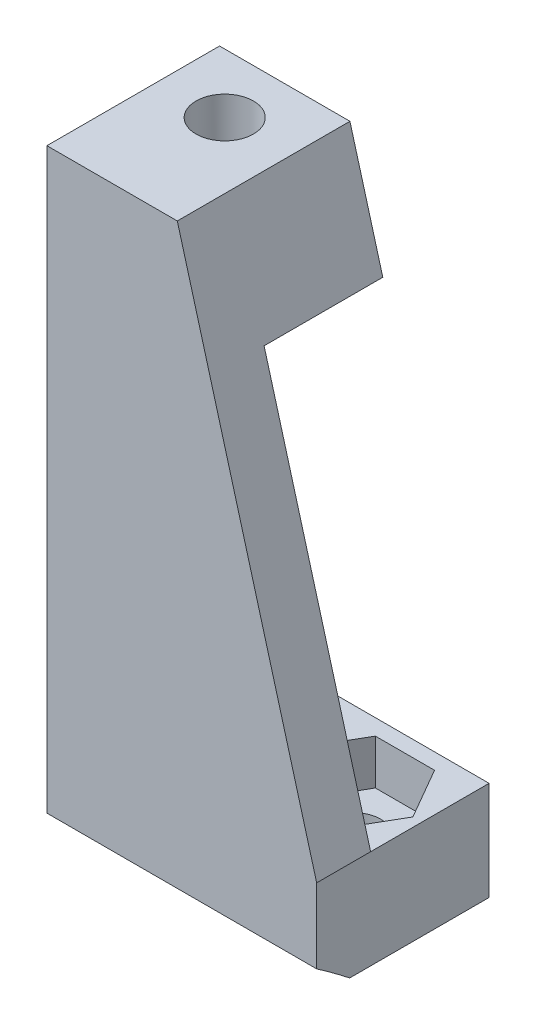
ISO-10303-21;
HEADER;
FILE_DESCRIPTION(('STEP AP214'),'2;1');
FILE_NAME('part.step','',(''),(''),'','','');
FILE_SCHEMA(('AUTOMOTIVE_DESIGN { 1 0 10303 214 1 1 1 1 }'));
ENDSEC;
DATA;
#1=APPLICATION_CONTEXT('core data for automotive mechanical design processes');
#2=APPLICATION_PROTOCOL_DEFINITION('international standard','automotive_design',2000,#1);
#3=PRODUCT_CONTEXT('',#1,'mechanical');
#4=PRODUCT('Part','Part','',(#3));
#5=PRODUCT_RELATED_PRODUCT_CATEGORY('part','',(#4));
#6=PRODUCT_DEFINITION_FORMATION('','',#4);
#7=PRODUCT_DEFINITION_CONTEXT('part definition',#1,'design');
#8=PRODUCT_DEFINITION('design','',#6,#7);
#9=PRODUCT_DEFINITION_SHAPE('','',#8);
#10=(LENGTH_UNIT() NAMED_UNIT(*) SI_UNIT(.MILLI.,.METRE.));
#11=(NAMED_UNIT(*) PLANE_ANGLE_UNIT() SI_UNIT($,.RADIAN.));
#12=(NAMED_UNIT(*) SI_UNIT($,.STERADIAN.) SOLID_ANGLE_UNIT());
#13=UNCERTAINTY_MEASURE_WITH_UNIT(LENGTH_MEASURE(1.E-05),#10,'distance_accuracy_value','');
#14=(GEOMETRIC_REPRESENTATION_CONTEXT(3) GLOBAL_UNCERTAINTY_ASSIGNED_CONTEXT((#13)) GLOBAL_UNIT_ASSIGNED_CONTEXT((#10,
#11,#12)) REPRESENTATION_CONTEXT('',''));
#15=CARTESIAN_POINT('',(0.,0.,0.));
#16=DIRECTION('',(0.,0.,1.));
#17=DIRECTION('',(1.,0.,0.));
#18=AXIS2_PLACEMENT_3D('',#15,#16,#17);
#19=CARTESIAN_POINT('',(-5.22270988784293,13.2099625185953,0.));
#20=DIRECTION('',(0.,1.,0.));
#21=DIRECTION('',(-1.,0.,0.));
#22=AXIS2_PLACEMENT_3D('',#19,#20,#21);
#23=PLANE('',#22);
#24=DIRECTION('',(0.500000000000012,0.,0.866025403784432));
#25=VECTOR('',#24,1.);
#26=CARTESIAN_POINT('',(-70.4651100151372,13.2099625185952,40.6830502357174));
#27=LINE('',#26,#25);
#28=CARTESIAN_POINT('',(-12.3045029566046,13.2099625185953,141.420176660142));
#29=VERTEX_POINT('',#28);
#30=CARTESIAN_POINT('',(-10.6590546894141,13.2099625185953,144.270176660142));
#31=VERTEX_POINT('',#30);
#32=EDGE_CURVE('E316',#29,#31,#27,.T.);
#33=ORIENTED_EDGE('',*,*,#32,.T.);
#34=DIRECTION('',(-1.,0.,0.));
#35=VECTOR('',#34,1.);
#36=CARTESIAN_POINT('',(-5.22270988784271,13.2099625185953,144.270176660142));
#37=LINE('',#36,#35);
#38=CARTESIAN_POINT('',(-7.36815815503317,13.2099625185953,144.270176660142));
#39=VERTEX_POINT('',#38);
#40=EDGE_CURVE('E50',#39,#31,#37,.T.);
#41=ORIENTED_EDGE('',*,*,#40,.F.);
#42=DIRECTION('',(0.500000000000001,0.,-0.866025403784438));
#43=VECTOR('',#42,1.);
#44=CARTESIAN_POINT('',(56.9447003818009,13.2099625185954,32.8770380943554));
#45=LINE('',#44,#43);
#46=CARTESIAN_POINT('',(-5.72270988784274,13.2099625185953,141.420176660142));
#47=VERTEX_POINT('',#46);
#48=EDGE_CURVE('E371',#39,#47,#45,.T.);
#49=ORIENTED_EDGE('',*,*,#48,.T.);
#50=DIRECTION('',(-0.499999999999999,0.,-0.866025403784439));
#51=VECTOR('',#50,1.);
#52=CARTESIAN_POINT('',(-65.5287652135649,13.2099625185952,37.8330502357154));
#53=LINE('',#52,#51);
#54=CARTESIAN_POINT('',(-7.36815815503318,13.2099625185953,138.570176660142));
#55=VERTEX_POINT('',#54);
#56=EDGE_CURVE('E368',#47,#55,#53,.T.);
#57=ORIENTED_EDGE('',*,*,#56,.T.);
#58=DIRECTION('',(-1.,0.,0.));
#59=VECTOR('',#58,1.);
#60=CARTESIAN_POINT('',(0.,13.2099625185953,138.570176660142));
#61=LINE('',#60,#59);
#62=CARTESIAN_POINT('',(-10.6590546894141,13.2099625185953,138.570176660142));
#63=VERTEX_POINT('',#62);
#64=EDGE_CURVE('E365',#55,#63,#61,.T.);
#65=ORIENTED_EDGE('',*,*,#64,.T.);
#66=DIRECTION('',(-0.499999999999997,0.,0.86602540378444));
#67=VECTOR('',#66,1.);
#68=CARTESIAN_POINT('',(52.0083555802292,13.2099625185954,30.0270380943549));
#69=LINE('',#68,#67);
#70=EDGE_CURVE('E362',#63,#29,#69,.T.);
#71=ORIENTED_EDGE('',*,*,#70,.T.);
#72=EDGE_LOOP('',(#33,#41,#49,#57,#65,#71));
#73=FACE_BOUND('',#72,.T.);
#74=CARTESIAN_POINT('',(-9.01360642222365,13.2099625185953,141.420176660142));
#75=DIRECTION('',(0.,1.,0.));
#76=DIRECTION('',(-1.,0.,0.));
#77=AXIS2_PLACEMENT_3D('',#74,#75,#76);
#78=CIRCLE('',#77,1.5);
#79=CARTESIAN_POINT('',(-10.5136064222236,13.2099625185953,141.420176660142));
#80=VERTEX_POINT('',#79);
#81=EDGE_CURVE('E414',#80,#80,#78,.T.);
#82=ORIENTED_EDGE('',*,*,#81,.F.);
#83=EDGE_LOOP('',(#82));
#84=FACE_BOUND('',#83,.T.);
#85=ADVANCED_FACE('F41',(#73,#84),#23,.T.);
#86=CARTESIAN_POINT('',(-5.2227098878427,-1.28139585204145E-12,137.670176660141));
#87=DIRECTION('',(0.,0.,-1.));
#88=DIRECTION('',(0.,1.,0.));
#89=AXIS2_PLACEMENT_3D('',#86,#87,#88);
#90=PLANE('',#89);
#91=DIRECTION('',(0.266756124696208,-0.963764063418564,0.));
#92=VECTOR('',#91,1.);
#93=CARTESIAN_POINT('',(-12.9727098878427,43.7099625185953,137.670176660142));
#94=LINE('',#93,#92);
#95=CARTESIAN_POINT('',(-12.9727098878427,43.7099625185953,137.670176660142));
#96=VERTEX_POINT('',#95);
#97=CARTESIAN_POINT('',(-11.145924173557,37.1099625185953,137.670176660142));
#98=VERTEX_POINT('',#97);
#99=EDGE_CURVE('E217',#96,#98,#94,.T.);
#100=ORIENTED_EDGE('',*,*,#99,.T.);
#101=DIRECTION('',(-1.,0.,0.));
#102=VECTOR('',#101,1.);
#103=CARTESIAN_POINT('',(-5.22270988784276,37.1099625185953,137.670176660142));
#104=LINE('',#103,#102);
#105=CARTESIAN_POINT('',(-20.2227098878428,37.1099625185952,137.670176660142));
#106=VERTEX_POINT('',#105);
#107=EDGE_CURVE('E242',#98,#106,#104,.T.);
#108=ORIENTED_EDGE('',*,*,#107,.T.);
#109=DIRECTION('',(0.,-1.,0.));
#110=VECTOR('',#109,1.);
#111=CARTESIAN_POINT('',(-20.2227098878427,-1.30290365743994E-12,137.670176660141));
#112=LINE('',#111,#110);
#113=CARTESIAN_POINT('',(-20.2227098878428,43.7099625185952,137.670176660142));
#114=VERTEX_POINT('',#113);
#115=EDGE_CURVE('E240',#114,#106,#112,.T.);
#116=ORIENTED_EDGE('',*,*,#115,.F.);
#117=DIRECTION('',(-1.,0.,0.));
#118=VECTOR('',#117,1.);
#119=CARTESIAN_POINT('',(-5.22270988784277,43.7099625185953,137.670176660142));
#120=LINE('',#119,#118);
#121=EDGE_CURVE('E232',#96,#114,#120,.T.);
#122=ORIENTED_EDGE('',*,*,#121,.F.);
#123=EDGE_LOOP('',(#100,#108,#116,#122));
#124=FACE_BOUND('',#123,.T.);
#125=DIRECTION('',(0.,-1.,0.));
#126=VECTOR('',#125,1.);
#127=CARTESIAN_POINT('',(-13.7852098878427,40.7099625185952,137.670176660142));
#128=LINE('',#127,#126);
#129=CARTESIAN_POINT('',(-13.7852098878427,40.7099625185952,137.670176660142));
#130=VERTEX_POINT('',#129);
#131=CARTESIAN_POINT('',(-13.7852098878427,38.1099625185953,137.670176660142));
#132=VERTEX_POINT('',#131);
#133=EDGE_CURVE('E468',#130,#132,#128,.T.);
#134=ORIENTED_EDGE('',*,*,#133,.F.);
#135=DIRECTION('',(1.,0.,0.));
#136=VECTOR('',#135,1.);
#137=CARTESIAN_POINT('',(1.42165620151545E-13,40.7099625185953,137.670176660142));
#138=LINE('',#137,#136);
#139=CARTESIAN_POINT('',(-19.4852098878427,40.7099625185952,137.670176660142));
#140=VERTEX_POINT('',#139);
#141=EDGE_CURVE('E434',#140,#130,#138,.T.);
#142=ORIENTED_EDGE('',*,*,#141,.F.);
#143=DIRECTION('',(0.,-1.,0.));
#144=VECTOR('',#143,1.);
#145=CARTESIAN_POINT('',(-19.4852098878427,40.7099625185952,137.670176660142));
#146=LINE('',#145,#144);
#147=CARTESIAN_POINT('',(-19.4852098878427,38.1099625185952,137.670176660142));
#148=VERTEX_POINT('',#147);
#149=EDGE_CURVE('E446',#140,#148,#146,.T.);
#150=ORIENTED_EDGE('',*,*,#149,.T.);
#151=DIRECTION('',(1.,0.,0.));
#152=VECTOR('',#151,1.);
#153=CARTESIAN_POINT('',(1.45893639753948E-13,38.1099625185953,137.670176660142));
#154=LINE('',#153,#152);
#155=EDGE_CURVE('E452',#148,#132,#154,.T.);
#156=ORIENTED_EDGE('',*,*,#155,.T.);
#157=EDGE_LOOP('',(#134,#142,#150,#156));
#158=FACE_BOUND('',#157,.T.);
#159=ADVANCED_FACE('F237',(#124,#158),#90,.T.);
#160=CARTESIAN_POINT('',(-16.6352098878427,43.7109625185953,140.970176660142));
#161=DIRECTION('',(0.,-1.,0.));
#162=DIRECTION('',(1.,0.,0.));
#163=AXIS2_PLACEMENT_3D('',#160,#161,#162);
#164=CYLINDRICAL_SURFACE('',#163,1.59555943405495);
#165=CARTESIAN_POINT('',(-16.6352098878427,43.7099625185952,140.970176660142));
#166=DIRECTION('',(0.,1.,0.));
#167=DIRECTION('',(-1.,0.,0.));
#168=AXIS2_PLACEMENT_3D('',#165,#166,#167);
#169=CIRCLE('',#168,1.59555943405495);
#170=CARTESIAN_POINT('',(-18.2307693218976,43.7099625185952,140.970176660142));
#171=VERTEX_POINT('',#170);
#172=EDGE_CURVE('E463',#171,#171,#169,.F.);
#173=ORIENTED_EDGE('',*,*,#172,.F.);
#174=EDGE_LOOP('',(#173));
#175=FACE_BOUND('',#174,.T.);
#176=CARTESIAN_POINT('',(-16.6352098878427,40.7099625185952,140.970176660142));
#177=DIRECTION('',(0.,-1.,0.));
#178=DIRECTION('',(1.,0.,0.));
#179=AXIS2_PLACEMENT_3D('',#176,#177,#178);
#180=CIRCLE('',#179,1.59555943405495);
#181=CARTESIAN_POINT('',(-15.0396504537877,40.7099625185952,140.970176660142));
#182=VERTEX_POINT('',#181);
#183=EDGE_CURVE('E427',#182,#182,#180,.T.);
#184=ORIENTED_EDGE('',*,*,#183,.T.);
#185=EDGE_LOOP('',(#184));
#186=FACE_BOUND('',#185,.T.);
#187=ADVANCED_FACE('F538',(#175,#186),#164,.F.);
#188=CARTESIAN_POINT('',(-5.22270988784292,10.2099625185953,0.));
#189=DIRECTION('',(0.,1.,0.));
#190=DIRECTION('',(-1.,0.,0.));
#191=AXIS2_PLACEMENT_3D('',#188,#189,#190);
#192=PLANE('',#191);
#193=CARTESIAN_POINT('',(-16.4318133534618,10.2099625185953,141.420176660142));
#194=DIRECTION('',(0.,1.,0.));
#195=DIRECTION('',(-1.,0.,0.));
#196=AXIS2_PLACEMENT_3D('',#193,#194,#195);
#197=CIRCLE('',#196,1.5);
#198=CARTESIAN_POINT('',(-17.9318133534618,10.2099625185953,141.420176660142));
#199=VERTEX_POINT('',#198);
#200=EDGE_CURVE('E418',#199,#199,#197,.F.);
#201=ORIENTED_EDGE('',*,*,#200,.F.);
#202=EDGE_LOOP('',(#201));
#203=FACE_BOUND('',#202,.T.);
#204=CARTESIAN_POINT('',(-9.01360642222364,10.2099625185953,141.420176660142));
#205=DIRECTION('',(0.,1.,0.));
#206=DIRECTION('',(-1.,0.,0.));
#207=AXIS2_PLACEMENT_3D('',#204,#205,#206);
#208=CIRCLE('',#207,1.5);
#209=CARTESIAN_POINT('',(-10.5136064222236,10.2099625185953,141.420176660142));
#210=VERTEX_POINT('',#209);
#211=EDGE_CURVE('E419',#210,#210,#208,.F.);
#212=ORIENTED_EDGE('',*,*,#211,.F.);
#213=EDGE_LOOP('',(#212));
#214=FACE_BOUND('',#213,.T.);
#215=DIRECTION('',(0.,0.,-1.));
#216=VECTOR('',#215,1.);
#217=CARTESIAN_POINT('',(-20.2227098878429,10.2099625185952,0.));
#218=LINE('',#217,#216);
#219=CARTESIAN_POINT('',(-20.2227098878427,10.2099625185952,145.433552954662));
#220=VERTEX_POINT('',#219);
#221=CARTESIAN_POINT('',(-20.2227098878427,10.2099625185952,137.682676660141));
#222=VERTEX_POINT('',#221);
#223=EDGE_CURVE('E268',#220,#222,#218,.T.);
#224=ORIENTED_EDGE('',*,*,#223,.T.);
#225=DIRECTION('',(-1.,0.,0.));
#226=VECTOR('',#225,1.);
#227=CARTESIAN_POINT('',(-5.22270988784272,10.2099625185953,137.682676660141));
#228=LINE('',#227,#226);
#229=CARTESIAN_POINT('',(-5.22270988784272,10.2099625185953,137.682676660141));
#230=VERTEX_POINT('',#229);
#231=EDGE_CURVE('E11',#230,#222,#228,.T.);
#232=ORIENTED_EDGE('',*,*,#231,.F.);
#233=DIRECTION('',(0.,0.,-1.));
#234=VECTOR('',#233,1.);
#235=CARTESIAN_POINT('',(-5.22270988784292,10.2099625185953,0.));
#236=LINE('',#235,#234);
#237=CARTESIAN_POINT('',(-5.2227098878427,10.2099625185953,145.433552954662));
#238=VERTEX_POINT('',#237);
#239=EDGE_CURVE('E288',#238,#230,#236,.T.);
#240=ORIENTED_EDGE('',*,*,#239,.F.);
#241=DIRECTION('',(-1.,0.,0.));
#242=VECTOR('',#241,1.);
#243=CARTESIAN_POINT('',(-5.2227098878427,10.2099625185953,145.433552954662));
#244=LINE('',#243,#242);
#245=EDGE_CURVE('E45',#238,#220,#244,.T.);
#246=ORIENTED_EDGE('',*,*,#245,.T.);
#247=EDGE_LOOP('',(#224,#232,#240,#246));
#248=FACE_BOUND('',#247,.T.);
#249=ADVANCED_FACE('F43',(#203,#214,#248),#192,.F.);
#250=CARTESIAN_POINT('',(-5.2227098878427,0.,137.682676660141));
#251=DIRECTION('',(0.,0.,-1.));
#252=DIRECTION('',(-1.,0.,0.));
#253=AXIS2_PLACEMENT_3D('',#250,#251,#252);
#254=PLANE('',#253);
#255=DIRECTION('',(0.,-1.,0.));
#256=VECTOR('',#255,1.);
#257=CARTESIAN_POINT('',(-20.2227098878427,0.,137.682676660141));
#258=LINE('',#257,#256);
#259=CARTESIAN_POINT('',(-20.2227098878427,15.7099625185952,137.682676660141));
#260=VERTEX_POINT('',#259);
#261=EDGE_CURVE('E286',#260,#222,#258,.T.);
#262=ORIENTED_EDGE('',*,*,#261,.F.);
#263=DIRECTION('',(-1.,0.,0.));
#264=VECTOR('',#263,1.);
#265=CARTESIAN_POINT('',(1.8270263101442E-13,15.7099625185953,137.682676660141));
#266=LINE('',#265,#264);
#267=CARTESIAN_POINT('',(-5.22270988784273,15.7099625185953,137.682676660141));
#268=VERTEX_POINT('',#267);
#269=EDGE_CURVE('E340',#268,#260,#266,.T.);
#270=ORIENTED_EDGE('',*,*,#269,.F.);
#271=DIRECTION('',(0.,-1.,0.));
#272=VECTOR('',#271,1.);
#273=CARTESIAN_POINT('',(-5.2227098878427,0.,137.682676660141));
#274=LINE('',#273,#272);
#275=EDGE_CURVE('E253',#268,#230,#274,.T.);
#276=ORIENTED_EDGE('',*,*,#275,.T.);
#277=ORIENTED_EDGE('',*,*,#231,.T.);
#278=EDGE_LOOP('',(#262,#270,#276,#277));
#279=FACE_BOUND('',#278,.T.);
#280=ADVANCED_FACE('F543',(#279),#254,.T.);
#281=DIRECTION('',(0.5,0.,0.866025403784438));
#282=VECTOR('',#281,1.);
#283=CARTESIAN_POINT('',(-76.028765213565,13.2099625185952,43.8952280622066));
#284=LINE('',#283,#282);
#285=CARTESIAN_POINT('',(-19.7227098878427,13.2099625185952,141.420176660142));
#286=VERTEX_POINT('',#285);
#287=CARTESIAN_POINT('',(-18.0772616206522,13.2099625185953,144.270176660142));
#288=VERTEX_POINT('',#287);
#289=EDGE_CURVE('E374',#286,#288,#284,.T.);
#290=ORIENTED_EDGE('',*,*,#289,.T.);
#291=CARTESIAN_POINT('',(-14.7863650862714,13.2099625185953,144.270176660142));
#292=VERTEX_POINT('',#291);
#293=EDGE_CURVE('E290',#292,#288,#37,.T.);
#294=ORIENTED_EDGE('',*,*,#293,.F.);
#295=DIRECTION('',(0.5,0.,-0.866025403784438));
#296=VECTOR('',#295,1.);
#297=CARTESIAN_POINT('',(51.3810451833722,13.2099625185954,29.6648602678643));
#298=LINE('',#297,#296);
#299=CARTESIAN_POINT('',(-13.140916819081,13.2099625185953,141.420176660142));
#300=VERTEX_POINT('',#299);
#301=EDGE_CURVE('E321',#292,#300,#298,.T.);
#302=ORIENTED_EDGE('',*,*,#301,.T.);
#303=DIRECTION('',(-0.499999999999999,0.,-0.866025403784439));
#304=VECTOR('',#303,1.);
#305=CARTESIAN_POINT('',(-71.0924204119936,13.2099625185952,41.0452280622064));
#306=LINE('',#305,#304);
#307=CARTESIAN_POINT('',(-14.7863650862714,13.2099625185953,138.570176660142));
#308=VERTEX_POINT('',#307);
#309=EDGE_CURVE('E383',#300,#308,#306,.T.);
#310=ORIENTED_EDGE('',*,*,#309,.T.);
#311=DIRECTION('',(-1.,0.,0.));
#312=VECTOR('',#311,1.);
#313=CARTESIAN_POINT('',(0.,13.2099625185953,138.570176660142));
#314=LINE('',#313,#312);
#315=CARTESIAN_POINT('',(-18.0772616206522,13.2099625185953,138.570176660142));
#316=VERTEX_POINT('',#315);
#317=EDGE_CURVE('E380',#308,#316,#314,.T.);
#318=ORIENTED_EDGE('',*,*,#317,.T.);
#319=DIRECTION('',(-0.500000000000008,0.,0.866025403784434));
#320=VECTOR('',#319,1.);
#321=CARTESIAN_POINT('',(46.4447003818017,13.2099625185953,26.8148602678652));
#322=LINE('',#321,#320);
#323=EDGE_CURVE('E377',#316,#286,#322,.T.);
#324=ORIENTED_EDGE('',*,*,#323,.T.);
#325=EDGE_LOOP('',(#290,#294,#302,#310,#318,#324));
#326=FACE_BOUND('',#325,.T.);
#327=CARTESIAN_POINT('',(-16.4318133534618,13.2099625185953,141.420176660142));
#328=DIRECTION('',(0.,1.,0.));
#329=DIRECTION('',(-1.,0.,0.));
#330=AXIS2_PLACEMENT_3D('',#327,#328,#329);
#331=CIRCLE('',#330,1.5);
#332=CARTESIAN_POINT('',(-17.9318133534618,13.2099625185953,141.420176660142));
#333=VERTEX_POINT('',#332);
#334=EDGE_CURVE('E415',#333,#333,#331,.T.);
#335=ORIENTED_EDGE('',*,*,#334,.F.);
#336=EDGE_LOOP('',(#335));
#337=FACE_BOUND('',#336,.T.);
#338=ADVANCED_FACE('F510',(#326,#337),#23,.T.);
#339=CARTESIAN_POINT('',(-5.22270988784269,-1.53301827055453E-13,144.270176660142));
#340=DIRECTION('',(0.,0.,-1.));
#341=DIRECTION('',(-1.,0.,0.));
#342=AXIS2_PLACEMENT_3D('',#339,#340,#341);
#343=PLANE('',#342);
#344=DIRECTION('',(-0.266756124696208,0.963764063418564,0.));
#345=VECTOR('',#344,1.);
#346=CARTESIAN_POINT('',(-1.18383614740858,1.11790255315571,144.270176660142));
#347=LINE('',#346,#345);
#348=CARTESIAN_POINT('',(-5.22270988784273,15.7099625185953,144.270176660142));
#349=VERTEX_POINT('',#348);
#350=CARTESIAN_POINT('',(-11.145924173557,37.1099625185953,144.270176660142));
#351=VERTEX_POINT('',#350);
#352=EDGE_CURVE('E314',#349,#351,#347,.T.);
#353=ORIENTED_EDGE('',*,*,#352,.F.);
#354=DIRECTION('',(1.,0.,0.));
#355=VECTOR('',#354,1.);
#356=CARTESIAN_POINT('',(1.92551711354055E-13,15.7099625185953,144.270176660142));
#357=LINE('',#356,#355);
#358=CARTESIAN_POINT('',(-7.36815815503318,15.7099625185953,144.270176660142));
#359=VERTEX_POINT('',#358);
#360=EDGE_CURVE('E333',#359,#349,#357,.T.);
#361=ORIENTED_EDGE('',*,*,#360,.F.);
#362=DIRECTION('',(0.,-1.,0.));
#363=VECTOR('',#362,1.);
#364=CARTESIAN_POINT('',(-7.36815815503318,15.7099625185953,144.270176660142));
#365=LINE('',#364,#363);
#366=EDGE_CURVE('E403',#359,#39,#365,.T.);
#367=ORIENTED_EDGE('',*,*,#366,.T.);
#368=ORIENTED_EDGE('',*,*,#40,.T.);
#369=DIRECTION('',(0.,-1.,0.));
#370=VECTOR('',#369,1.);
#371=CARTESIAN_POINT('',(-10.6590546894141,15.7099625185953,144.270176660142));
#372=LINE('',#371,#370);
#373=CARTESIAN_POINT('',(-10.6590546894141,15.7099625185953,144.270176660142));
#374=VERTEX_POINT('',#373);
#375=EDGE_CURVE('E388',#374,#31,#372,.T.);
#376=ORIENTED_EDGE('',*,*,#375,.F.);
#377=CARTESIAN_POINT('',(-14.7863650862714,15.7099625185953,144.270176660142));
#378=VERTEX_POINT('',#377);
#379=EDGE_CURVE('E337',#378,#374,#357,.T.);
#380=ORIENTED_EDGE('',*,*,#379,.F.);
#381=DIRECTION('',(0.,-1.,0.));
#382=VECTOR('',#381,1.);
#383=CARTESIAN_POINT('',(-14.7863650862714,15.7099625185953,144.270176660142));
#384=LINE('',#383,#382);
#385=EDGE_CURVE('E390',#378,#292,#384,.T.);
#386=ORIENTED_EDGE('',*,*,#385,.T.);
#387=ORIENTED_EDGE('',*,*,#293,.T.);
#388=DIRECTION('',(0.,-1.,0.));
#389=VECTOR('',#388,1.);
#390=CARTESIAN_POINT('',(-18.0772616206522,15.7099625185953,144.270176660142));
#391=LINE('',#390,#389);
#392=CARTESIAN_POINT('',(-18.0772616206522,15.7099625185953,144.270176660142));
#393=VERTEX_POINT('',#392);
#394=EDGE_CURVE('E401',#393,#288,#391,.T.);
#395=ORIENTED_EDGE('',*,*,#394,.F.);
#396=CARTESIAN_POINT('',(-20.2227098878427,15.7099625185952,144.270176660142));
#397=VERTEX_POINT('',#396);
#398=EDGE_CURVE('E303',#397,#393,#357,.T.);
#399=ORIENTED_EDGE('',*,*,#398,.F.);
#400=DIRECTION('',(0.,-1.,0.));
#401=VECTOR('',#400,1.);
#402=CARTESIAN_POINT('',(-20.2227098878427,-1.74809632453935E-13,144.270176660142));
#403=LINE('',#402,#401);
#404=CARTESIAN_POINT('',(-20.2227098878427,37.1099625185952,144.270176660142));
#405=VERTEX_POINT('',#404);
#406=EDGE_CURVE('E283',#405,#397,#403,.T.);
#407=ORIENTED_EDGE('',*,*,#406,.F.);
#408=DIRECTION('',(-1.,0.,0.));
#409=VECTOR('',#408,1.);
#410=CARTESIAN_POINT('',(-5.22270988784275,37.1099625185953,144.270176660142));
#411=LINE('',#410,#409);
#412=EDGE_CURVE('E244',#351,#405,#411,.T.);
#413=ORIENTED_EDGE('',*,*,#412,.F.);
#414=EDGE_LOOP('',(#353,#361,#367,#368,#376,#380,#386,#387,#395,#399,#407,#413));
#415=FACE_BOUND('',#414,.T.);
#416=ADVANCED_FACE('F301',(#415),#343,.T.);
#417=CARTESIAN_POINT('',(-5.22270988784296,37.1099625185953,0.));
#418=DIRECTION('',(0.,-1.,0.));
#419=DIRECTION('',(1.,0.,0.));
#420=AXIS2_PLACEMENT_3D('',#417,#418,#419);
#421=PLANE('',#420);
#422=DIRECTION('',(0.,0.,-1.));
#423=VECTOR('',#422,1.);
#424=CARTESIAN_POINT('',(-11.145924173557,37.1099625185953,0.));
#425=LINE('',#424,#423);
#426=EDGE_CURVE('E222',#351,#98,#425,.T.);
#427=ORIENTED_EDGE('',*,*,#426,.F.);
#428=ORIENTED_EDGE('',*,*,#412,.T.);
#429=DIRECTION('',(0.,0.,1.));
#430=VECTOR('',#429,1.);
#431=CARTESIAN_POINT('',(-20.222709887843,37.1099625185952,0.));
#432=LINE('',#431,#430);
#433=EDGE_CURVE('E280',#106,#405,#432,.T.);
#434=ORIENTED_EDGE('',*,*,#433,.F.);
#435=ORIENTED_EDGE('',*,*,#107,.F.);
#436=EDGE_LOOP('',(#427,#428,#434,#435));
#437=FACE_BOUND('',#436,.T.);
#438=CARTESIAN_POINT('',(-16.6352098878427,37.1099625185952,140.970176660142));
#439=DIRECTION('',(0.,-1.,0.));
#440=DIRECTION('',(1.,0.,0.));
#441=AXIS2_PLACEMENT_3D('',#438,#439,#440);
#442=CIRCLE('',#441,1.59555943405495);
#443=CARTESIAN_POINT('',(-15.0396504537877,37.1099625185952,140.970176660142));
#444=VERTEX_POINT('',#443);
#445=EDGE_CURVE('E271',#444,#444,#442,.T.);
#446=ORIENTED_EDGE('',*,*,#445,.F.);
#447=EDGE_LOOP('',(#446));
#448=FACE_BOUND('',#447,.T.);
#449=ADVANCED_FACE('F296',(#437,#448),#421,.T.);
#450=CARTESIAN_POINT('',(-5.22270988784297,43.7099625185953,0.));
#451=DIRECTION('',(0.,1.,0.));
#452=DIRECTION('',(-1.,0.,0.));
#453=AXIS2_PLACEMENT_3D('',#450,#451,#452);
#454=PLANE('',#453);
#455=DIRECTION('',(0.,0.,1.));
#456=VECTOR('',#455,1.);
#457=CARTESIAN_POINT('',(-12.9727098878427,43.7099625185953,137.670176660142));
#458=LINE('',#457,#456);
#459=CARTESIAN_POINT('',(-12.9727098878427,43.7099625185953,147.270176660142));
#460=VERTEX_POINT('',#459);
#461=EDGE_CURVE('E220',#96,#460,#458,.T.);
#462=ORIENTED_EDGE('',*,*,#461,.F.);
#463=ORIENTED_EDGE('',*,*,#121,.T.);
#464=DIRECTION('',(0.,0.,-1.));
#465=VECTOR('',#464,1.);
#466=CARTESIAN_POINT('',(-20.222709887843,43.7099625185952,0.));
#467=LINE('',#466,#465);
#468=CARTESIAN_POINT('',(-20.2227098878428,43.7099625185952,147.270176660142));
#469=VERTEX_POINT('',#468);
#470=EDGE_CURVE('E277',#469,#114,#467,.T.);
#471=ORIENTED_EDGE('',*,*,#470,.F.);
#472=DIRECTION('',(-1.,0.,0.));
#473=VECTOR('',#472,1.);
#474=CARTESIAN_POINT('',(-5.22270988784275,43.7099625185953,147.270176660142));
#475=LINE('',#474,#473);
#476=EDGE_CURVE('E234',#460,#469,#475,.T.);
#477=ORIENTED_EDGE('',*,*,#476,.F.);
#478=EDGE_LOOP('',(#462,#463,#471,#477));
#479=FACE_BOUND('',#478,.T.);
#480=ORIENTED_EDGE('',*,*,#172,.T.);
#481=EDGE_LOOP('',(#480));
#482=FACE_BOUND('',#481,.T.);
#483=ADVANCED_FACE('F229',(#479,#482),#454,.T.);
#484=CARTESIAN_POINT('',(-5.22270988784269,0.,147.270176660142));
#485=DIRECTION('',(0.,0.,1.));
#486=DIRECTION('',(1.,0.,0.));
#487=AXIS2_PLACEMENT_3D('',#484,#485,#486);
#488=PLANE('',#487);
#489=DIRECTION('',(0.266756124696208,-0.963764063418564,0.));
#490=VECTOR('',#489,1.);
#491=CARTESIAN_POINT('',(-12.9727098878427,43.7099625185953,147.270176660142));
#492=LINE('',#491,#490);
#493=CARTESIAN_POINT('',(-5.22270988784271,15.7099625185953,147.270176660142));
#494=VERTEX_POINT('',#493);
#495=EDGE_CURVE('E58',#460,#494,#492,.T.);
#496=ORIENTED_EDGE('',*,*,#495,.F.);
#497=ORIENTED_EDGE('',*,*,#476,.T.);
#498=DIRECTION('',(0.,1.,0.));
#499=VECTOR('',#498,1.);
#500=CARTESIAN_POINT('',(-20.2227098878427,0.,147.270176660142));
#501=LINE('',#500,#499);
#502=CARTESIAN_POINT('',(-20.2227098878427,11.5664527943735,147.270176660142));
#503=VERTEX_POINT('',#502);
#504=EDGE_CURVE('E274',#503,#469,#501,.T.);
#505=ORIENTED_EDGE('',*,*,#504,.F.);
#506=DIRECTION('',(-1.,0.,0.));
#507=VECTOR('',#506,1.);
#508=CARTESIAN_POINT('',(-5.2227098878427,11.5664527943735,147.270176660142));
#509=LINE('',#508,#507);
#510=CARTESIAN_POINT('',(-5.2227098878427,11.5664527943735,147.270176660142));
#511=VERTEX_POINT('',#510);
#512=EDGE_CURVE('E246',#511,#503,#509,.T.);
#513=ORIENTED_EDGE('',*,*,#512,.F.);
#514=DIRECTION('',(0.,1.,0.));
#515=VECTOR('',#514,1.);
#516=CARTESIAN_POINT('',(-5.22270988784269,0.,147.270176660142));
#517=LINE('',#516,#515);
#518=EDGE_CURVE('E259',#511,#494,#517,.T.);
#519=ORIENTED_EDGE('',*,*,#518,.T.);
#520=EDGE_LOOP('',(#496,#497,#505,#513,#519));
#521=FACE_BOUND('',#520,.T.);
#522=ADVANCED_FACE('F308',(#521),#488,.T.);
#523=CARTESIAN_POINT('',(-5.22270988784263,-18.9404700879835,168.382676660141));
#524=DIRECTION('',(-1.,0.,0.));
#525=DIRECTION('',(0.,0.,1.));
#526=AXIS2_PLACEMENT_3D('',#523,#524,#525);
#527=CYLINDRICAL_SURFACE('',#526,37.1000000000006);
#528=CARTESIAN_POINT('',(-20.2227098878426,-18.9404700879835,168.382676660141));
#529=DIRECTION('',(-1.,0.,0.));
#530=DIRECTION('',(0.,0.,1.));
#531=AXIS2_PLACEMENT_3D('',#528,#529,#530);
#532=CIRCLE('',#531,37.1000000000006);
#533=EDGE_CURVE('E270',#220,#503,#532,.F.);
#534=ORIENTED_EDGE('',*,*,#533,.F.);
#535=ORIENTED_EDGE('',*,*,#245,.F.);
#536=CARTESIAN_POINT('',(-5.22270988784263,-18.9404700879835,168.382676660141));
#537=DIRECTION('',(-1.,0.,0.));
#538=DIRECTION('',(0.,0.,1.));
#539=AXIS2_PLACEMENT_3D('',#536,#537,#538);
#540=CIRCLE('',#539,37.1000000000006);
#541=EDGE_CURVE('E264',#238,#511,#540,.F.);
#542=ORIENTED_EDGE('',*,*,#541,.T.);
#543=ORIENTED_EDGE('',*,*,#512,.T.);
#544=EDGE_LOOP('',(#534,#535,#542,#543));
#545=FACE_BOUND('',#544,.T.);
#546=ADVANCED_FACE('F477',(#545),#527,.F.);
#547=CARTESIAN_POINT('',(-5.22270988784291,0.,0.));
#548=DIRECTION('',(-1.,0.,0.));
#549=DIRECTION('',(0.,0.,1.));
#550=AXIS2_PLACEMENT_3D('',#547,#548,#549);
#551=PLANE('',#550);
#552=DIRECTION('',(0.,0.,-1.));
#553=VECTOR('',#552,1.);
#554=CARTESIAN_POINT('',(-5.22270988784293,15.7099625185953,0.));
#555=LINE('',#554,#553);
#556=EDGE_CURVE('E336',#349,#268,#555,.T.);
#557=ORIENTED_EDGE('',*,*,#556,.F.);
#558=DIRECTION('',(0.,0.,1.));
#559=VECTOR('',#558,1.);
#560=CARTESIAN_POINT('',(-5.22270988784273,15.7099625185953,137.670176660142));
#561=LINE('',#560,#559);
#562=EDGE_CURVE('E235',#349,#494,#561,.T.);
#563=ORIENTED_EDGE('',*,*,#562,.T.);
#564=ORIENTED_EDGE('',*,*,#518,.F.);
#565=ORIENTED_EDGE('',*,*,#541,.F.);
#566=ORIENTED_EDGE('',*,*,#239,.T.);
#567=ORIENTED_EDGE('',*,*,#275,.F.);
#568=EDGE_LOOP('',(#557,#563,#564,#565,#566,#567));
#569=FACE_BOUND('',#568,.T.);
#570=ADVANCED_FACE('F480',(#569),#551,.F.);
#571=CARTESIAN_POINT('',(-20.2227098878429,0.,0.));
#572=DIRECTION('',(-1.,0.,0.));
#573=DIRECTION('',(0.,0.,1.));
#574=AXIS2_PLACEMENT_3D('',#571,#572,#573);
#575=PLANE('',#574);
#576=ORIENTED_EDGE('',*,*,#223,.F.);
#577=ORIENTED_EDGE('',*,*,#533,.T.);
#578=ORIENTED_EDGE('',*,*,#504,.T.);
#579=ORIENTED_EDGE('',*,*,#470,.T.);
#580=ORIENTED_EDGE('',*,*,#115,.T.);
#581=ORIENTED_EDGE('',*,*,#433,.T.);
#582=ORIENTED_EDGE('',*,*,#406,.T.);
#583=DIRECTION('',(0.,0.,1.));
#584=VECTOR('',#583,1.);
#585=CARTESIAN_POINT('',(-20.2227098878429,15.7099625185952,0.));
#586=LINE('',#585,#584);
#587=EDGE_CURVE('E343',#260,#397,#586,.T.);
#588=ORIENTED_EDGE('',*,*,#587,.F.);
#589=ORIENTED_EDGE('',*,*,#261,.T.);
#590=EDGE_LOOP('',(#576,#577,#578,#579,#580,#581,#582,#588,#589));
#591=FACE_BOUND('',#590,.T.);
#592=ADVANCED_FACE('F306',(#591),#575,.T.);
#593=CARTESIAN_POINT('',(-16.6352098878427,38.1099625185952,140.970176660142));
#594=DIRECTION('',(0.,-1.,0.));
#595=DIRECTION('',(1.,0.,0.));
#596=AXIS2_PLACEMENT_3D('',#593,#594,#595);
#597=CIRCLE('',#596,1.59555943405495);
#598=CARTESIAN_POINT('',(-15.0396504537877,38.1099625185952,140.970176660142));
#599=VERTEX_POINT('',#598);
#600=EDGE_CURVE('E422',#599,#599,#597,.T.);
#601=ORIENTED_EDGE('',*,*,#600,.F.);
#602=EDGE_LOOP('',(#601));
#603=FACE_BOUND('',#602,.T.);
#604=ORIENTED_EDGE('',*,*,#445,.T.);
#605=EDGE_LOOP('',(#604));
#606=FACE_BOUND('',#605,.T.);
#607=ADVANCED_FACE('F555',(#603,#606),#164,.F.);
#608=CARTESIAN_POINT('',(-19.4852098878427,40.7099625185952,0.));
#609=DIRECTION('',(-1.,0.,0.));
#610=DIRECTION('',(0.,-1.,0.));
#611=AXIS2_PLACEMENT_3D('',#608,#609,#610);
#612=PLANE('',#611);
#613=DIRECTION('',(0.,0.,-1.));
#614=VECTOR('',#613,1.);
#615=CARTESIAN_POINT('',(-19.4852098878427,38.1099625185952,0.));
#616=LINE('',#615,#614);
#617=CARTESIAN_POINT('',(-19.4852098878427,38.1099625185952,142.615624927332));
#618=VERTEX_POINT('',#617);
#619=EDGE_CURVE('E449',#618,#148,#616,.T.);
#620=ORIENTED_EDGE('',*,*,#619,.T.);
#621=ORIENTED_EDGE('',*,*,#149,.F.);
#622=DIRECTION('',(0.,0.,-1.));
#623=VECTOR('',#622,1.);
#624=CARTESIAN_POINT('',(-19.4852098878427,40.7099625185952,0.));
#625=LINE('',#624,#623);
#626=CARTESIAN_POINT('',(-19.4852098878427,40.7099625185952,142.615624927332));
#627=VERTEX_POINT('',#626);
#628=EDGE_CURVE('E430',#627,#140,#625,.T.);
#629=ORIENTED_EDGE('',*,*,#628,.F.);
#630=DIRECTION('',(0.,-1.,0.));
#631=VECTOR('',#630,1.);
#632=CARTESIAN_POINT('',(-19.4852098878427,40.7099625185952,142.615624927332));
#633=LINE('',#632,#631);
#634=EDGE_CURVE('E461',#627,#618,#633,.T.);
#635=ORIENTED_EDGE('',*,*,#634,.T.);
#636=EDGE_LOOP('',(#620,#621,#629,#635));
#637=FACE_BOUND('',#636,.T.);
#638=ADVANCED_FACE('F560',(#637),#612,.F.);
#639=CARTESIAN_POINT('',(-66.6256795537923,40.7099625185952,115.399062075971));
#640=DIRECTION('',(-0.500000000000001,0.,0.866025403784438));
#641=DIRECTION('',(0.866025403784438,0.,0.500000000000001));
#642=AXIS2_PLACEMENT_3D('',#639,#640,#641);
#643=PLANE('',#642);
#644=DIRECTION('',(-0.866025403784438,0.,-0.500000000000001));
#645=VECTOR('',#644,1.);
#646=CARTESIAN_POINT('',(-66.6256795537923,38.1099625185952,115.399062075971));
#647=LINE('',#646,#645);
#648=CARTESIAN_POINT('',(-16.6352098878427,38.1099625185953,144.261073194523));
#649=VERTEX_POINT('',#648);
#650=EDGE_CURVE('E431',#649,#618,#647,.T.);
#651=ORIENTED_EDGE('',*,*,#650,.T.);
#652=ORIENTED_EDGE('',*,*,#634,.F.);
#653=DIRECTION('',(-0.866025403784438,0.,-0.500000000000001));
#654=VECTOR('',#653,1.);
#655=CARTESIAN_POINT('',(-66.6256795537923,40.7099625185952,115.399062075971));
#656=LINE('',#655,#654);
#657=CARTESIAN_POINT('',(-16.6352098878427,40.7099625185952,144.261073194523));
#658=VERTEX_POINT('',#657);
#659=EDGE_CURVE('E443',#658,#627,#656,.T.);
#660=ORIENTED_EDGE('',*,*,#659,.F.);
#661=DIRECTION('',(0.,-1.,0.));
#662=VECTOR('',#661,1.);
#663=CARTESIAN_POINT('',(-16.6352098878427,40.7099625185952,144.261073194523));
#664=LINE('',#663,#662);
#665=EDGE_CURVE('E464',#658,#649,#664,.T.);
#666=ORIENTED_EDGE('',*,*,#665,.T.);
#667=EDGE_LOOP('',(#651,#652,#660,#666));
#668=FACE_BOUND('',#667,.T.);
#669=ADVANCED_FACE('F564',(#668),#643,.F.);
#670=CARTESIAN_POINT('',(58.3080746098709,40.7099625185954,100.992547715813));
#671=DIRECTION('',(0.500000000000003,0.,0.866025403784437));
#672=DIRECTION('',(0.866025403784437,0.,-0.500000000000003));
#673=AXIS2_PLACEMENT_3D('',#670,#671,#672);
#674=PLANE('',#673);
#675=DIRECTION('',(-0.866025403784437,0.,0.500000000000003));
#676=VECTOR('',#675,1.);
#677=CARTESIAN_POINT('',(58.308074609871,38.1099625185954,100.992547715813));
#678=LINE('',#677,#676);
#679=CARTESIAN_POINT('',(-13.7852098878427,38.1099625185953,142.615624927332));
#680=VERTEX_POINT('',#679);
#681=EDGE_CURVE('E456',#680,#649,#678,.T.);
#682=ORIENTED_EDGE('',*,*,#681,.T.);
#683=ORIENTED_EDGE('',*,*,#665,.F.);
#684=DIRECTION('',(-0.866025403784437,0.,0.500000000000003));
#685=VECTOR('',#684,1.);
#686=CARTESIAN_POINT('',(58.3080746098709,40.7099625185954,100.992547715813));
#687=LINE('',#686,#685);
#688=CARTESIAN_POINT('',(-13.7852098878427,40.7099625185952,142.615624927332));
#689=VERTEX_POINT('',#688);
#690=EDGE_CURVE('E440',#689,#658,#687,.T.);
#691=ORIENTED_EDGE('',*,*,#690,.F.);
#692=DIRECTION('',(0.,-1.,0.));
#693=VECTOR('',#692,1.);
#694=CARTESIAN_POINT('',(-13.7852098878427,40.7099625185952,142.615624927332));
#695=LINE('',#694,#693);
#696=EDGE_CURVE('E466',#689,#680,#695,.T.);
#697=ORIENTED_EDGE('',*,*,#696,.T.);
#698=EDGE_LOOP('',(#682,#683,#691,#697));
#699=FACE_BOUND('',#698,.T.);
#700=ADVANCED_FACE('F570',(#699),#674,.F.);
#701=CARTESIAN_POINT('',(-13.7852098878427,40.7099625185952,0.));
#702=DIRECTION('',(1.,0.,0.));
#703=DIRECTION('',(0.,1.,0.));
#704=AXIS2_PLACEMENT_3D('',#701,#702,#703);
#705=PLANE('',#704);
#706=DIRECTION('',(0.,0.,1.));
#707=VECTOR('',#706,1.);
#708=CARTESIAN_POINT('',(-13.7852098878427,38.1099625185953,0.));
#709=LINE('',#708,#707);
#710=EDGE_CURVE('E66',#132,#680,#709,.T.);
#711=ORIENTED_EDGE('',*,*,#710,.T.);
#712=ORIENTED_EDGE('',*,*,#696,.F.);
#713=DIRECTION('',(0.,0.,1.));
#714=VECTOR('',#713,1.);
#715=CARTESIAN_POINT('',(-13.7852098878427,40.7099625185952,0.));
#716=LINE('',#715,#714);
#717=EDGE_CURVE('E437',#130,#689,#716,.T.);
#718=ORIENTED_EDGE('',*,*,#717,.F.);
#719=ORIENTED_EDGE('',*,*,#133,.T.);
#720=EDGE_LOOP('',(#711,#712,#718,#719));
#721=FACE_BOUND('',#720,.T.);
#722=ADVANCED_FACE('F566',(#721),#705,.F.);
#723=CARTESIAN_POINT('',(0.,40.7099625185953,0.));
#724=DIRECTION('',(0.,-1.,0.));
#725=DIRECTION('',(1.,0.,0.));
#726=AXIS2_PLACEMENT_3D('',#723,#724,#725);
#727=PLANE('',#726);
#728=ORIENTED_EDGE('',*,*,#183,.F.);
#729=EDGE_LOOP('',(#728));
#730=FACE_BOUND('',#729,.T.);
#731=ORIENTED_EDGE('',*,*,#628,.T.);
#732=ORIENTED_EDGE('',*,*,#141,.T.);
#733=ORIENTED_EDGE('',*,*,#717,.T.);
#734=ORIENTED_EDGE('',*,*,#690,.T.);
#735=ORIENTED_EDGE('',*,*,#659,.T.);
#736=EDGE_LOOP('',(#731,#732,#733,#734,#735));
#737=FACE_BOUND('',#736,.T.);
#738=ADVANCED_FACE('F569',(#730,#737),#727,.T.);
#739=CARTESIAN_POINT('',(0.,38.1099625185953,0.));
#740=DIRECTION('',(0.,-1.,0.));
#741=DIRECTION('',(1.,0.,0.));
#742=AXIS2_PLACEMENT_3D('',#739,#740,#741);
#743=PLANE('',#742);
#744=ORIENTED_EDGE('',*,*,#600,.T.);
#745=EDGE_LOOP('',(#744));
#746=FACE_BOUND('',#745,.T.);
#747=ORIENTED_EDGE('',*,*,#619,.F.);
#748=ORIENTED_EDGE('',*,*,#650,.F.);
#749=ORIENTED_EDGE('',*,*,#681,.F.);
#750=ORIENTED_EDGE('',*,*,#710,.F.);
#751=ORIENTED_EDGE('',*,*,#155,.F.);
#752=EDGE_LOOP('',(#747,#748,#749,#750,#751));
#753=FACE_BOUND('',#752,.T.);
#754=ADVANCED_FACE('F578',(#746,#753),#743,.F.);
#755=CARTESIAN_POINT('',(-9.01360642222364,10.2089625185952,141.420176660142));
#756=DIRECTION('',(0.,1.,0.));
#757=DIRECTION('',(-1.,0.,0.));
#758=AXIS2_PLACEMENT_3D('',#755,#756,#757);
#759=CYLINDRICAL_SURFACE('',#758,1.5);
#760=ORIENTED_EDGE('',*,*,#81,.T.);
#761=EDGE_LOOP('',(#760));
#762=FACE_BOUND('',#761,.T.);
#763=ORIENTED_EDGE('',*,*,#211,.T.);
#764=EDGE_LOOP('',(#763));
#765=FACE_BOUND('',#764,.T.);
#766=ADVANCED_FACE('F581',(#762,#765),#759,.F.);
#767=CARTESIAN_POINT('',(-16.4318133534618,10.2089625185952,141.420176660142));
#768=DIRECTION('',(0.,1.,0.));
#769=DIRECTION('',(-1.,0.,0.));
#770=AXIS2_PLACEMENT_3D('',#767,#768,#769);
#771=CYLINDRICAL_SURFACE('',#770,1.5);
#772=ORIENTED_EDGE('',*,*,#334,.T.);
#773=EDGE_LOOP('',(#772));
#774=FACE_BOUND('',#773,.T.);
#775=ORIENTED_EDGE('',*,*,#200,.T.);
#776=EDGE_LOOP('',(#775));
#777=FACE_BOUND('',#776,.T.);
#778=ADVANCED_FACE('F588',(#774,#777),#771,.F.);
#779=CARTESIAN_POINT('',(-70.4651100151372,15.7099625185952,40.6830502357174));
#780=DIRECTION('',(0.866025403784431,0.,-0.500000000000012));
#781=DIRECTION('',(-0.500000000000012,0.,-0.866025403784432));
#782=AXIS2_PLACEMENT_3D('',#779,#780,#781);
#783=PLANE('',#782);
#784=ORIENTED_EDGE('',*,*,#32,.F.);
#785=DIRECTION('',(0.,-1.,0.));
#786=VECTOR('',#785,1.);
#787=CARTESIAN_POINT('',(-12.3045029566046,15.7099625185953,141.420176660142));
#788=LINE('',#787,#786);
#789=CARTESIAN_POINT('',(-12.3045029566046,15.7099625185953,141.420176660142));
#790=VERTEX_POINT('',#789);
#791=EDGE_CURVE('E412',#790,#29,#788,.T.);
#792=ORIENTED_EDGE('',*,*,#791,.F.);
#793=DIRECTION('',(0.500000000000012,0.,0.866025403784432));
#794=VECTOR('',#793,1.);
#795=CARTESIAN_POINT('',(-70.4651100151372,15.7099625185952,40.6830502357174));
#796=LINE('',#795,#794);
#797=EDGE_CURVE('E317',#790,#374,#796,.T.);
#798=ORIENTED_EDGE('',*,*,#797,.T.);
#799=ORIENTED_EDGE('',*,*,#375,.T.);
#800=EDGE_LOOP('',(#784,#792,#798,#799));
#801=FACE_BOUND('',#800,.T.);
#802=ADVANCED_FACE('F500',(#801),#783,.T.);
#803=CARTESIAN_POINT('',(52.0083555802292,15.7099625185954,30.0270380943549));
#804=DIRECTION('',(0.86602540378444,0.,0.499999999999997));
#805=DIRECTION('',(0.499999999999997,0.,-0.86602540378444));
#806=AXIS2_PLACEMENT_3D('',#803,#804,#805);
#807=PLANE('',#806);
#808=ORIENTED_EDGE('',*,*,#70,.F.);
#809=DIRECTION('',(0.,-1.,0.));
#810=VECTOR('',#809,1.);
#811=CARTESIAN_POINT('',(-10.6590546894141,15.7099625185953,138.570176660142));
#812=LINE('',#811,#810);
#813=CARTESIAN_POINT('',(-10.6590546894141,15.7099625185953,138.570176660142));
#814=VERTEX_POINT('',#813);
#815=EDGE_CURVE('E410',#814,#63,#812,.T.);
#816=ORIENTED_EDGE('',*,*,#815,.F.);
#817=DIRECTION('',(-0.499999999999997,0.,0.86602540378444));
#818=VECTOR('',#817,1.);
#819=CARTESIAN_POINT('',(52.0083555802292,15.7099625185954,30.0270380943549));
#820=LINE('',#819,#818);
#821=EDGE_CURVE('E320',#814,#790,#820,.T.);
#822=ORIENTED_EDGE('',*,*,#821,.T.);
#823=ORIENTED_EDGE('',*,*,#791,.T.);
#824=EDGE_LOOP('',(#808,#816,#822,#823));
#825=FACE_BOUND('',#824,.T.);
#826=ADVANCED_FACE('F595',(#825),#807,.T.);
#827=CARTESIAN_POINT('',(0.,15.7099625185953,138.570176660142));
#828=DIRECTION('',(0.,0.,1.));
#829=DIRECTION('',(0.,-1.,0.));
#830=AXIS2_PLACEMENT_3D('',#827,#828,#829);
#831=PLANE('',#830);
#832=ORIENTED_EDGE('',*,*,#64,.F.);
#833=DIRECTION('',(0.,-1.,0.));
#834=VECTOR('',#833,1.);
#835=CARTESIAN_POINT('',(-7.36815815503318,15.7099625185953,138.570176660142));
#836=LINE('',#835,#834);
#837=CARTESIAN_POINT('',(-7.36815815503318,15.7099625185953,138.570176660142));
#838=VERTEX_POINT('',#837);
#839=EDGE_CURVE('E408',#838,#55,#836,.T.);
#840=ORIENTED_EDGE('',*,*,#839,.F.);
#841=DIRECTION('',(-1.,0.,0.));
#842=VECTOR('',#841,1.);
#843=CARTESIAN_POINT('',(0.,15.7099625185953,138.570176660142));
#844=LINE('',#843,#842);
#845=EDGE_CURVE('E324',#838,#814,#844,.T.);
#846=ORIENTED_EDGE('',*,*,#845,.T.);
#847=ORIENTED_EDGE('',*,*,#815,.T.);
#848=EDGE_LOOP('',(#832,#840,#846,#847));
#849=FACE_BOUND('',#848,.T.);
#850=ADVANCED_FACE('F598',(#849),#831,.T.);
#851=CARTESIAN_POINT('',(-65.5287652135649,15.7099625185952,37.8330502357154));
#852=DIRECTION('',(-0.866025403784439,0.,0.499999999999999));
#853=DIRECTION('',(0.499999999999999,0.,0.866025403784439));
#854=AXIS2_PLACEMENT_3D('',#851,#852,#853);
#855=PLANE('',#854);
#856=ORIENTED_EDGE('',*,*,#56,.F.);
#857=DIRECTION('',(0.,-1.,0.));
#858=VECTOR('',#857,1.);
#859=CARTESIAN_POINT('',(-5.72270988784274,15.7099625185953,141.420176660142));
#860=LINE('',#859,#858);
#861=CARTESIAN_POINT('',(-5.72270988784274,15.7099625185953,141.420176660142));
#862=VERTEX_POINT('',#861);
#863=EDGE_CURVE('E406',#862,#47,#860,.T.);
#864=ORIENTED_EDGE('',*,*,#863,.F.);
#865=DIRECTION('',(-0.499999999999999,0.,-0.866025403784439));
#866=VECTOR('',#865,1.);
#867=CARTESIAN_POINT('',(-65.5287652135649,15.7099625185952,37.8330502357154));
#868=LINE('',#867,#866);
#869=EDGE_CURVE('E327',#862,#838,#868,.T.);
#870=ORIENTED_EDGE('',*,*,#869,.T.);
#871=ORIENTED_EDGE('',*,*,#839,.T.);
#872=EDGE_LOOP('',(#856,#864,#870,#871));
#873=FACE_BOUND('',#872,.T.);
#874=ADVANCED_FACE('F602',(#873),#855,.T.);
#875=CARTESIAN_POINT('',(56.9447003818009,15.7099625185954,32.8770380943554));
#876=DIRECTION('',(-0.866025403784438,0.,-0.500000000000001));
#877=DIRECTION('',(-0.500000000000001,0.,0.866025403784438));
#878=AXIS2_PLACEMENT_3D('',#875,#876,#877);
#879=PLANE('',#878);
#880=ORIENTED_EDGE('',*,*,#48,.F.);
#881=ORIENTED_EDGE('',*,*,#366,.F.);
#882=DIRECTION('',(0.500000000000001,0.,-0.866025403784438));
#883=VECTOR('',#882,1.);
#884=CARTESIAN_POINT('',(56.9447003818009,15.7099625185954,32.8770380943554));
#885=LINE('',#884,#883);
#886=EDGE_CURVE('E330',#359,#862,#885,.T.);
#887=ORIENTED_EDGE('',*,*,#886,.T.);
#888=ORIENTED_EDGE('',*,*,#863,.T.);
#889=EDGE_LOOP('',(#880,#881,#887,#888));
#890=FACE_BOUND('',#889,.T.);
#891=ADVANCED_FACE('F490',(#890),#879,.T.);
#892=CARTESIAN_POINT('',(-76.028765213565,15.7099625185952,43.8952280622066));
#893=DIRECTION('',(0.866025403784438,0.,-0.5));
#894=DIRECTION('',(-0.5,0.,-0.866025403784438));
#895=AXIS2_PLACEMENT_3D('',#892,#893,#894);
#896=PLANE('',#895);
#897=ORIENTED_EDGE('',*,*,#289,.F.);
#898=DIRECTION('',(0.,-1.,0.));
#899=VECTOR('',#898,1.);
#900=CARTESIAN_POINT('',(-19.7227098878427,15.7099625185952,141.420176660142));
#901=LINE('',#900,#899);
#902=CARTESIAN_POINT('',(-19.7227098878427,15.7099625185952,141.420176660142));
#903=VERTEX_POINT('',#902);
#904=EDGE_CURVE('E399',#903,#286,#901,.T.);
#905=ORIENTED_EDGE('',*,*,#904,.F.);
#906=DIRECTION('',(0.5,0.,0.866025403784438));
#907=VECTOR('',#906,1.);
#908=CARTESIAN_POINT('',(-76.028765213565,15.7099625185952,43.8952280622066));
#909=LINE('',#908,#907);
#910=EDGE_CURVE('E345',#903,#393,#909,.T.);
#911=ORIENTED_EDGE('',*,*,#910,.T.);
#912=ORIENTED_EDGE('',*,*,#394,.T.);
#913=EDGE_LOOP('',(#897,#905,#911,#912));
#914=FACE_BOUND('',#913,.T.);
#915=ADVANCED_FACE('F508',(#914),#896,.T.);
#916=CARTESIAN_POINT('',(46.4447003818016,15.7099625185953,26.8148602678652));
#917=DIRECTION('',(0.866025403784434,0.,0.500000000000008));
#918=DIRECTION('',(0.500000000000008,0.,-0.866025403784434));
#919=AXIS2_PLACEMENT_3D('',#916,#917,#918);
#920=PLANE('',#919);
#921=ORIENTED_EDGE('',*,*,#323,.F.);
#922=DIRECTION('',(0.,-1.,0.));
#923=VECTOR('',#922,1.);
#924=CARTESIAN_POINT('',(-18.0772616206522,15.7099625185953,138.570176660142));
#925=LINE('',#924,#923);
#926=CARTESIAN_POINT('',(-18.0772616206522,15.7099625185953,138.570176660142));
#927=VERTEX_POINT('',#926);
#928=EDGE_CURVE('E397',#927,#316,#925,.T.);
#929=ORIENTED_EDGE('',*,*,#928,.F.);
#930=DIRECTION('',(-0.500000000000008,0.,0.866025403784434));
#931=VECTOR('',#930,1.);
#932=CARTESIAN_POINT('',(46.4447003818016,15.7099625185953,26.8148602678652));
#933=LINE('',#932,#931);
#934=EDGE_CURVE('E348',#927,#903,#933,.T.);
#935=ORIENTED_EDGE('',*,*,#934,.T.);
#936=ORIENTED_EDGE('',*,*,#904,.T.);
#937=EDGE_LOOP('',(#921,#929,#935,#936));
#938=FACE_BOUND('',#937,.T.);
#939=ADVANCED_FACE('F515',(#938),#920,.T.);
#940=CARTESIAN_POINT('',(0.,15.7099625185953,138.570176660142));
#941=DIRECTION('',(0.,0.,1.));
#942=DIRECTION('',(0.,-1.,0.));
#943=AXIS2_PLACEMENT_3D('',#940,#941,#942);
#944=PLANE('',#943);
#945=ORIENTED_EDGE('',*,*,#317,.F.);
#946=DIRECTION('',(0.,-1.,0.));
#947=VECTOR('',#946,1.);
#948=CARTESIAN_POINT('',(-14.7863650862714,15.7099625185953,138.570176660142));
#949=LINE('',#948,#947);
#950=CARTESIAN_POINT('',(-14.7863650862714,15.7099625185953,138.570176660142));
#951=VERTEX_POINT('',#950);
#952=EDGE_CURVE('E395',#951,#308,#949,.T.);
#953=ORIENTED_EDGE('',*,*,#952,.F.);
#954=DIRECTION('',(-1.,0.,0.));
#955=VECTOR('',#954,1.);
#956=CARTESIAN_POINT('',(0.,15.7099625185953,138.570176660142));
#957=LINE('',#956,#955);
#958=EDGE_CURVE('E351',#951,#927,#957,.T.);
#959=ORIENTED_EDGE('',*,*,#958,.T.);
#960=ORIENTED_EDGE('',*,*,#928,.T.);
#961=EDGE_LOOP('',(#945,#953,#959,#960));
#962=FACE_BOUND('',#961,.T.);
#963=ADVANCED_FACE('F519',(#962),#944,.T.);
#964=CARTESIAN_POINT('',(-71.0924204119936,15.7099625185952,41.0452280622064));
#965=DIRECTION('',(-0.866025403784439,0.,0.499999999999999));
#966=DIRECTION('',(0.499999999999999,0.,0.866025403784439));
#967=AXIS2_PLACEMENT_3D('',#964,#965,#966);
#968=PLANE('',#967);
#969=ORIENTED_EDGE('',*,*,#309,.F.);
#970=DIRECTION('',(0.,-1.,0.));
#971=VECTOR('',#970,1.);
#972=CARTESIAN_POINT('',(-13.140916819081,15.7099625185953,141.420176660142));
#973=LINE('',#972,#971);
#974=CARTESIAN_POINT('',(-13.140916819081,15.7099625185953,141.420176660142));
#975=VERTEX_POINT('',#974);
#976=EDGE_CURVE('E393',#975,#300,#973,.T.);
#977=ORIENTED_EDGE('',*,*,#976,.F.);
#978=DIRECTION('',(-0.499999999999999,0.,-0.866025403784439));
#979=VECTOR('',#978,1.);
#980=CARTESIAN_POINT('',(-71.0924204119936,15.7099625185952,41.0452280622064));
#981=LINE('',#980,#979);
#982=EDGE_CURVE('E354',#975,#951,#981,.T.);
#983=ORIENTED_EDGE('',*,*,#982,.T.);
#984=ORIENTED_EDGE('',*,*,#952,.T.);
#985=EDGE_LOOP('',(#969,#977,#983,#984));
#986=FACE_BOUND('',#985,.T.);
#987=ADVANCED_FACE('F522',(#986),#968,.T.);
#988=CARTESIAN_POINT('',(51.3810451833722,15.7099625185954,29.6648602678643));
#989=DIRECTION('',(-0.866025403784438,0.,-0.5));
#990=DIRECTION('',(-0.5,0.,0.866025403784438));
#991=AXIS2_PLACEMENT_3D('',#988,#989,#990);
#992=PLANE('',#991);
#993=ORIENTED_EDGE('',*,*,#301,.F.);
#994=ORIENTED_EDGE('',*,*,#385,.F.);
#995=DIRECTION('',(0.5,0.,-0.866025403784438));
#996=VECTOR('',#995,1.);
#997=CARTESIAN_POINT('',(51.3810451833722,15.7099625185954,29.6648602678643));
#998=LINE('',#997,#996);
#999=EDGE_CURVE('E357',#378,#975,#998,.T.);
#1000=ORIENTED_EDGE('',*,*,#999,.T.);
#1001=ORIENTED_EDGE('',*,*,#976,.T.);
#1002=EDGE_LOOP('',(#993,#994,#1000,#1001));
#1003=FACE_BOUND('',#1002,.T.);
#1004=ADVANCED_FACE('F524',(#1003),#992,.T.);
#1005=CARTESIAN_POINT('',(0.,15.7099625185953,0.));
#1006=DIRECTION('',(0.,1.,0.));
#1007=DIRECTION('',(-1.,0.,0.));
#1008=AXIS2_PLACEMENT_3D('',#1005,#1006,#1007);
#1009=PLANE('',#1008);
#1010=ORIENTED_EDGE('',*,*,#797,.F.);
#1011=ORIENTED_EDGE('',*,*,#821,.F.);
#1012=ORIENTED_EDGE('',*,*,#845,.F.);
#1013=ORIENTED_EDGE('',*,*,#869,.F.);
#1014=ORIENTED_EDGE('',*,*,#886,.F.);
#1015=ORIENTED_EDGE('',*,*,#360,.T.);
#1016=ORIENTED_EDGE('',*,*,#556,.T.);
#1017=ORIENTED_EDGE('',*,*,#269,.T.);
#1018=ORIENTED_EDGE('',*,*,#587,.T.);
#1019=ORIENTED_EDGE('',*,*,#398,.T.);
#1020=ORIENTED_EDGE('',*,*,#910,.F.);
#1021=ORIENTED_EDGE('',*,*,#934,.F.);
#1022=ORIENTED_EDGE('',*,*,#958,.F.);
#1023=ORIENTED_EDGE('',*,*,#982,.F.);
#1024=ORIENTED_EDGE('',*,*,#999,.F.);
#1025=ORIENTED_EDGE('',*,*,#379,.T.);
#1026=EDGE_LOOP('',(#1010,#1011,#1012,#1013,#1014,#1015,#1016,#1017,#1018,#1019,#1020,#1021,
#1022,#1023,#1024,#1025));
#1027=FACE_BOUND('',#1026,.T.);
#1028=ADVANCED_FACE('F486',(#1027),#1009,.T.);
#1029=CARTESIAN_POINT('',(-12.9727098878427,43.7099625185953,137.670176660142));
#1030=DIRECTION('',(-0.963764063418564,-0.266756124696208,0.));
#1031=DIRECTION('',(0.266756124696208,-0.963764063418564,0.));
#1032=AXIS2_PLACEMENT_3D('',#1029,#1030,#1031);
#1033=PLANE('',#1032);
#1034=ORIENTED_EDGE('',*,*,#352,.T.);
#1035=ORIENTED_EDGE('',*,*,#426,.T.);
#1036=ORIENTED_EDGE('',*,*,#99,.F.);
#1037=ORIENTED_EDGE('',*,*,#461,.T.);
#1038=ORIENTED_EDGE('',*,*,#495,.T.);
#1039=ORIENTED_EDGE('',*,*,#562,.F.);
#1040=EDGE_LOOP('',(#1034,#1035,#1036,#1037,#1038,#1039));
#1041=FACE_BOUND('',#1040,.T.);
#1042=ADVANCED_FACE('F219',(#1041),#1033,.F.);
#1043=CLOSED_SHELL('',(#85,#159,#187,#249,#280,#338,#416,#449,#483,#522,#546,#570,#592,#607,
#638,#669,#700,#722,#738,#754,#766,#778,#802,#826,#850,#874,#891,#915,#939,#963,#987,#1004,
#1028,#1042));
#1044=MANIFOLD_SOLID_BREP('B2',#1043);
#1045=ADVANCED_BREP_SHAPE_REPRESENTATION('',(#18,#1044),#14);
#1046=SHAPE_DEFINITION_REPRESENTATION(#9,#1045);
ENDSEC;
END-ISO-10303-21;
